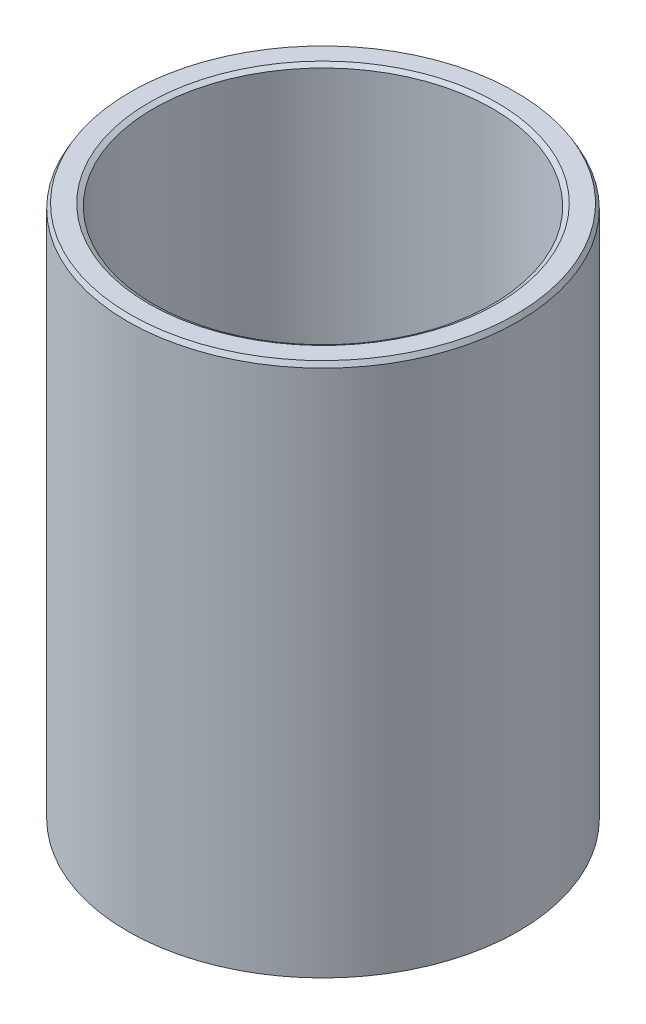
ISO-10303-21;
HEADER;
FILE_DESCRIPTION(('STEP AP214'),'2;1');
FILE_NAME('part.step','',(''),(''),'','','');
FILE_SCHEMA(('AUTOMOTIVE_DESIGN { 1 0 10303 214 1 1 1 1 }'));
ENDSEC;
DATA;
#1=APPLICATION_CONTEXT('core data for automotive mechanical design processes');
#2=APPLICATION_PROTOCOL_DEFINITION('international standard','automotive_design',2000,#1);
#3=PRODUCT_CONTEXT('',#1,'mechanical');
#4=PRODUCT('Part','Part','',(#3));
#5=PRODUCT_RELATED_PRODUCT_CATEGORY('part','',(#4));
#6=PRODUCT_DEFINITION_FORMATION('','',#4);
#7=PRODUCT_DEFINITION_CONTEXT('part definition',#1,'design');
#8=PRODUCT_DEFINITION('design','',#6,#7);
#9=PRODUCT_DEFINITION_SHAPE('','',#8);
#10=(LENGTH_UNIT() NAMED_UNIT(*) SI_UNIT(.MILLI.,.METRE.));
#11=(NAMED_UNIT(*) PLANE_ANGLE_UNIT() SI_UNIT($,.RADIAN.));
#12=(NAMED_UNIT(*) SI_UNIT($,.STERADIAN.) SOLID_ANGLE_UNIT());
#13=UNCERTAINTY_MEASURE_WITH_UNIT(LENGTH_MEASURE(1.E-05),#10,'distance_accuracy_value','');
#14=(GEOMETRIC_REPRESENTATION_CONTEXT(3) GLOBAL_UNCERTAINTY_ASSIGNED_CONTEXT((#13)) GLOBAL_UNIT_ASSIGNED_CONTEXT((#10,
#11,#12)) REPRESENTATION_CONTEXT('',''));
#15=CARTESIAN_POINT('',(0.,0.,0.));
#16=DIRECTION('',(0.,0.,1.));
#17=DIRECTION('',(1.,0.,0.));
#18=AXIS2_PLACEMENT_3D('',#15,#16,#17);
#19=CARTESIAN_POINT('',(0.,116.46110257911,0.));
#20=DIRECTION('',(0.,-1.,0.));
#21=DIRECTION('',(0.,0.,-1.));
#22=AXIS2_PLACEMENT_3D('',#19,#20,#21);
#23=CYLINDRICAL_SURFACE('',#22,42.5);
#24=CARTESIAN_POINT('',(0.,0.585033973561938,0.));
#25=DIRECTION('',(0.,1.,0.));
#26=DIRECTION('',(0.,0.,1.));
#27=AXIS2_PLACEMENT_3D('',#24,#25,#26);
#28=CIRCLE('',#27,42.5);
#29=CARTESIAN_POINT('',(0.,0.585033973561938,42.5));
#30=VERTEX_POINT('',#29);
#31=EDGE_CURVE('E10',#30,#30,#28,.T.);
#32=ORIENTED_EDGE('',*,*,#31,.T.);
#33=EDGE_LOOP('',(#32));
#34=FACE_BOUND('',#33,.T.);
#35=CARTESIAN_POINT('',(0.,115.447794012747,0.));
#36=DIRECTION('',(0.,1.,0.));
#37=DIRECTION('',(0.,0.,1.));
#38=AXIS2_PLACEMENT_3D('',#35,#36,#37);
#39=CIRCLE('',#38,42.5);
#40=CARTESIAN_POINT('',(0.,115.447794012747,42.5));
#41=VERTEX_POINT('',#40);
#42=EDGE_CURVE('E50',#41,#41,#39,.F.);
#43=ORIENTED_EDGE('',*,*,#42,.T.);
#44=EDGE_LOOP('',(#43));
#45=FACE_BOUND('',#44,.T.);
#46=ADVANCED_FACE('F39',(#34,#45),#23,.T.);
#47=CARTESIAN_POINT('',(0.,116.46110257911,0.));
#48=DIRECTION('',(0.,1.,0.));
#49=DIRECTION('',(0.,0.,1.));
#50=AXIS2_PLACEMENT_3D('',#47,#48,#49);
#51=PLANE('',#50);
#52=CARTESIAN_POINT('',(0.,116.46110257911,0.));
#53=DIRECTION('',(0.,1.,0.));
#54=DIRECTION('',(0.,0.,1.));
#55=AXIS2_PLACEMENT_3D('',#52,#53,#54);
#56=CIRCLE('',#55,37.8808446924073);
#57=CARTESIAN_POINT('',(0.,116.46110257911,37.8808446924073));
#58=VERTEX_POINT('',#57);
#59=EDGE_CURVE('E58',#58,#58,#56,.F.);
#60=ORIENTED_EDGE('',*,*,#59,.T.);
#61=EDGE_LOOP('',(#60));
#62=FACE_BOUND('',#61,.T.);
#63=CARTESIAN_POINT('',(0.,116.46110257911,0.));
#64=DIRECTION('',(0.,1.,0.));
#65=DIRECTION('',(0.,0.,1.));
#66=AXIS2_PLACEMENT_3D('',#63,#64,#65);
#67=CIRCLE('',#66,41.914966026438);
#68=CARTESIAN_POINT('',(0.,116.46110257911,41.914966026438));
#69=VERTEX_POINT('',#68);
#70=EDGE_CURVE('E61',#69,#69,#67,.T.);
#71=ORIENTED_EDGE('',*,*,#70,.T.);
#72=EDGE_LOOP('',(#71));
#73=FACE_BOUND('',#72,.T.);
#74=ADVANCED_FACE('F88',(#62,#73),#51,.T.);
#75=CARTESIAN_POINT('',(0.,0.,0.));
#76=DIRECTION('',(0.,1.,0.));
#77=DIRECTION('',(0.,0.,1.));
#78=AXIS2_PLACEMENT_3D('',#75,#76,#77);
#79=PLANE('',#78);
#80=CARTESIAN_POINT('',(0.,0.,0.));
#81=DIRECTION('',(0.,1.,0.));
#82=DIRECTION('',(0.,0.,1.));
#83=AXIS2_PLACEMENT_3D('',#80,#81,#82);
#84=CIRCLE('',#83,37.452570099606);
#85=CARTESIAN_POINT('',(0.,0.,37.452570099606));
#86=VERTEX_POINT('',#85);
#87=EDGE_CURVE('E51',#86,#86,#84,.T.);
#88=ORIENTED_EDGE('',*,*,#87,.T.);
#89=EDGE_LOOP('',(#88));
#90=FACE_BOUND('',#89,.T.);
#91=CARTESIAN_POINT('',(0.,0.,0.));
#92=DIRECTION('',(0.,1.,0.));
#93=DIRECTION('',(0.,0.,1.));
#94=AXIS2_PLACEMENT_3D('',#91,#92,#93);
#95=CIRCLE('',#94,41.4866914336368);
#96=CARTESIAN_POINT('',(0.,0.,41.4866914336368));
#97=VERTEX_POINT('',#96);
#98=EDGE_CURVE('E54',#97,#97,#95,.F.);
#99=ORIENTED_EDGE('',*,*,#98,.T.);
#100=EDGE_LOOP('',(#99));
#101=FACE_BOUND('',#100,.T.);
#102=ADVANCED_FACE('F83',(#90,#101),#79,.F.);
#103=CARTESIAN_POINT('',(0.,116.46110257911,0.));
#104=DIRECTION('',(0.,-1.,0.));
#105=DIRECTION('',(0.,0.,-1.));
#106=AXIS2_PLACEMENT_3D('',#103,#104,#105);
#107=CYLINDRICAL_SURFACE('',#106,36.8675361260441);
#108=CARTESIAN_POINT('',(0.,115.876068605548,0.));
#109=DIRECTION('',(0.,1.,0.));
#110=DIRECTION('',(0.,0.,1.));
#111=AXIS2_PLACEMENT_3D('',#108,#109,#110);
#112=CIRCLE('',#111,36.8675361260441);
#113=CARTESIAN_POINT('',(0.,115.876068605548,36.8675361260441));
#114=VERTEX_POINT('',#113);
#115=EDGE_CURVE('E67',#114,#114,#112,.T.);
#116=ORIENTED_EDGE('',*,*,#115,.T.);
#117=EDGE_LOOP('',(#116));
#118=FACE_BOUND('',#117,.T.);
#119=CARTESIAN_POINT('',(0.,1.01330856636322,0.));
#120=DIRECTION('',(0.,1.,0.));
#121=DIRECTION('',(0.,0.,1.));
#122=AXIS2_PLACEMENT_3D('',#119,#120,#121);
#123=CIRCLE('',#122,36.8675361260441);
#124=CARTESIAN_POINT('',(0.,1.01330856636322,36.8675361260441));
#125=VERTEX_POINT('',#124);
#126=EDGE_CURVE('E69',#125,#125,#123,.F.);
#127=ORIENTED_EDGE('',*,*,#126,.T.);
#128=EDGE_LOOP('',(#127));
#129=FACE_BOUND('',#128,.T.);
#130=ADVANCED_FACE('F71',(#118,#129),#107,.F.);
#131=CARTESIAN_POINT('',(0.,115.876068605548,0.));
#132=DIRECTION('',(0.,1.,0.));
#133=DIRECTION('',(0.,0.,1.));
#134=AXIS2_PLACEMENT_3D('',#131,#132,#133);
#135=CONICAL_SURFACE('',#134,36.8675361260441,1.04719755119661);
#136=ORIENTED_EDGE('',*,*,#59,.F.);
#137=EDGE_LOOP('',(#136));
#138=FACE_BOUND('',#137,.T.);
#139=ORIENTED_EDGE('',*,*,#115,.F.);
#140=EDGE_LOOP('',(#139));
#141=FACE_BOUND('',#140,.T.);
#142=ADVANCED_FACE('F77',(#138,#141),#135,.F.);
#143=CARTESIAN_POINT('',(0.,0.,0.));
#144=DIRECTION('',(0.,-1.,0.));
#145=DIRECTION('',(0.,0.,-1.));
#146=AXIS2_PLACEMENT_3D('',#143,#144,#145);
#147=CONICAL_SURFACE('',#146,37.452570099606,0.523598775598302);
#148=ORIENTED_EDGE('',*,*,#126,.F.);
#149=EDGE_LOOP('',(#148));
#150=FACE_BOUND('',#149,.T.);
#151=ORIENTED_EDGE('',*,*,#87,.F.);
#152=EDGE_LOOP('',(#151));
#153=FACE_BOUND('',#152,.T.);
#154=ADVANCED_FACE('F73',(#150,#153),#147,.F.);
#155=CARTESIAN_POINT('',(0.,0.585033973561938,0.));
#156=DIRECTION('',(0.,1.,0.));
#157=DIRECTION('',(0.,0.,1.));
#158=AXIS2_PLACEMENT_3D('',#155,#156,#157);
#159=CONICAL_SURFACE('',#158,42.5,1.0471975511966);
#160=ORIENTED_EDGE('',*,*,#98,.F.);
#161=EDGE_LOOP('',(#160));
#162=FACE_BOUND('',#161,.T.);
#163=ORIENTED_EDGE('',*,*,#31,.F.);
#164=EDGE_LOOP('',(#163));
#165=FACE_BOUND('',#164,.T.);
#166=ADVANCED_FACE('F76',(#162,#165),#159,.T.);
#167=CARTESIAN_POINT('',(0.,116.46110257911,0.));
#168=DIRECTION('',(0.,-1.,0.));
#169=DIRECTION('',(0.,0.,-1.));
#170=AXIS2_PLACEMENT_3D('',#167,#168,#169);
#171=CONICAL_SURFACE('',#170,41.914966026438,0.523598775598306);
#172=ORIENTED_EDGE('',*,*,#42,.F.);
#173=EDGE_LOOP('',(#172));
#174=FACE_BOUND('',#173,.T.);
#175=ORIENTED_EDGE('',*,*,#70,.F.);
#176=EDGE_LOOP('',(#175));
#177=FACE_BOUND('',#176,.T.);
#178=ADVANCED_FACE('F45',(#174,#177),#171,.T.);
#179=CLOSED_SHELL('',(#46,#74,#102,#130,#142,#154,#166,#178));
#180=MANIFOLD_SOLID_BREP('B2',#179);
#181=ADVANCED_BREP_SHAPE_REPRESENTATION('',(#18,#180),#14);
#182=SHAPE_DEFINITION_REPRESENTATION(#9,#181);
ENDSEC;
END-ISO-10303-21;
